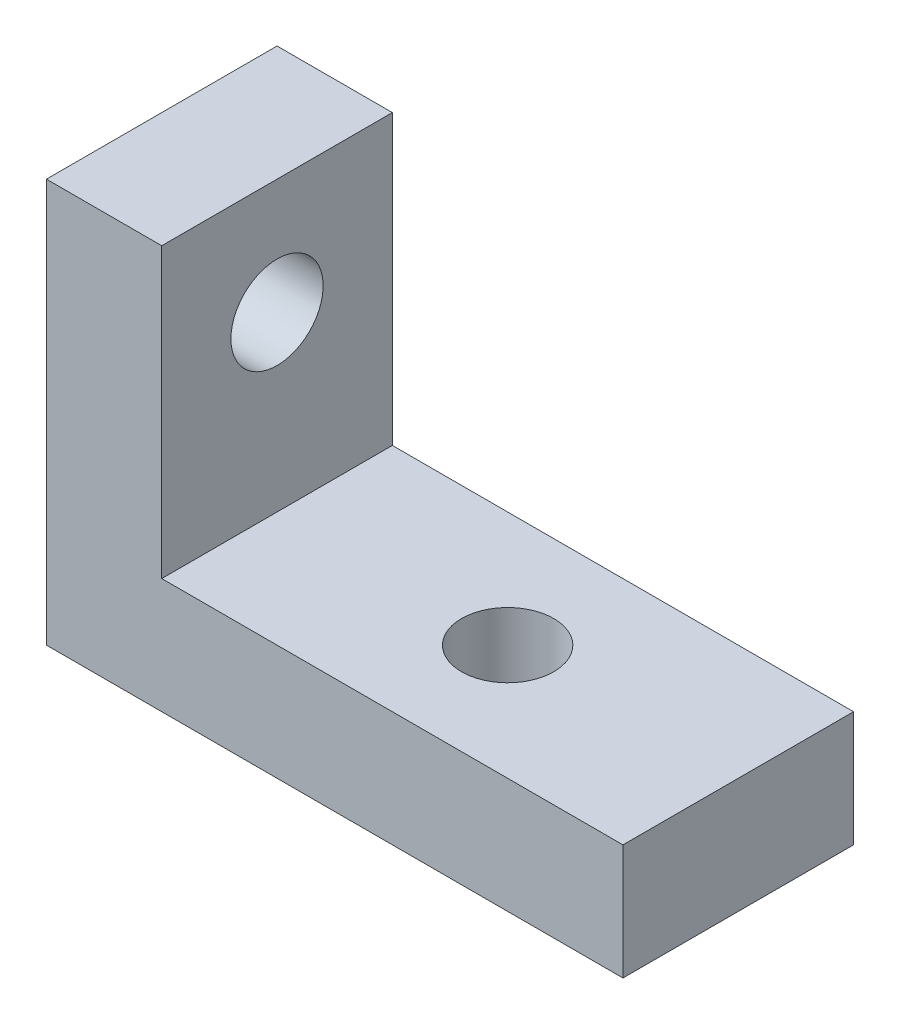
ISO-10303-21;
HEADER;
FILE_DESCRIPTION(('STEP AP214'),'2;1');
FILE_NAME('part.step','',(''),(''),'','','');
FILE_SCHEMA(('AUTOMOTIVE_DESIGN { 1 0 10303 214 1 1 1 1 }'));
ENDSEC;
DATA;
#1=APPLICATION_CONTEXT('core data for automotive mechanical design processes');
#2=APPLICATION_PROTOCOL_DEFINITION('international standard','automotive_design',2000,#1);
#3=PRODUCT_CONTEXT('',#1,'mechanical');
#4=PRODUCT('Part','Part','',(#3));
#5=PRODUCT_RELATED_PRODUCT_CATEGORY('part','',(#4));
#6=PRODUCT_DEFINITION_FORMATION('','',#4);
#7=PRODUCT_DEFINITION_CONTEXT('part definition',#1,'design');
#8=PRODUCT_DEFINITION('design','',#6,#7);
#9=PRODUCT_DEFINITION_SHAPE('','',#8);
#10=(LENGTH_UNIT() NAMED_UNIT(*) SI_UNIT(.MILLI.,.METRE.));
#11=(NAMED_UNIT(*) PLANE_ANGLE_UNIT() SI_UNIT($,.RADIAN.));
#12=(NAMED_UNIT(*) SI_UNIT($,.STERADIAN.) SOLID_ANGLE_UNIT());
#13=UNCERTAINTY_MEASURE_WITH_UNIT(LENGTH_MEASURE(1.E-05),#10,'distance_accuracy_value','');
#14=(GEOMETRIC_REPRESENTATION_CONTEXT(3) GLOBAL_UNCERTAINTY_ASSIGNED_CONTEXT((#13)) GLOBAL_UNIT_ASSIGNED_CONTEXT((#10,
#11,#12)) REPRESENTATION_CONTEXT('',''));
#15=CARTESIAN_POINT('',(0.,0.,0.));
#16=DIRECTION('',(0.,0.,1.));
#17=DIRECTION('',(1.,0.,0.));
#18=AXIS2_PLACEMENT_3D('',#15,#16,#17);
#19=CARTESIAN_POINT('',(-3.21733333333332,-27.3473333333333,5.08));
#20=DIRECTION('',(0.,-1.,0.));
#21=DIRECTION('',(1.,0.,0.));
#22=AXIS2_PLACEMENT_3D('',#19,#20,#21);
#23=PLANE('',#22);
#24=CARTESIAN_POINT('',(-8.29733333333332,-27.3473333333333,2.54));
#25=DIRECTION('',(0.,1.,0.));
#26=DIRECTION('',(-1.,0.,0.));
#27=AXIS2_PLACEMENT_3D('',#24,#25,#26);
#28=CIRCLE('',#27,1.016);
#29=CARTESIAN_POINT('',(-9.31333333333332,-27.3473333333333,2.54));
#30=VERTEX_POINT('',#29);
#31=EDGE_CURVE('E183',#30,#30,#28,.T.);
#32=ORIENTED_EDGE('',*,*,#31,.F.);
#33=EDGE_LOOP('',(#32));
#34=FACE_BOUND('',#33,.T.);
#35=DIRECTION('',(-1.,0.,0.));
#36=VECTOR('',#35,1.);
#37=CARTESIAN_POINT('',(-3.21733333333332,-27.3473333333333,0.));
#38=LINE('',#37,#36);
#39=CARTESIAN_POINT('',(-3.21733333333332,-27.3473333333333,0.));
#40=VERTEX_POINT('',#39);
#41=CARTESIAN_POINT('',(-13.3773333333333,-27.3473333333333,0.));
#42=VERTEX_POINT('',#41);
#43=EDGE_CURVE('E129',#40,#42,#38,.T.);
#44=ORIENTED_EDGE('',*,*,#43,.T.);
#45=DIRECTION('',(0.,0.,-1.));
#46=VECTOR('',#45,1.);
#47=CARTESIAN_POINT('',(-13.3773333333333,-27.3473333333333,5.08));
#48=LINE('',#47,#46);
#49=CARTESIAN_POINT('',(-13.3773333333333,-27.3473333333333,5.08));
#50=VERTEX_POINT('',#49);
#51=EDGE_CURVE('E11',#50,#42,#48,.T.);
#52=ORIENTED_EDGE('',*,*,#51,.F.);
#53=DIRECTION('',(-1.,0.,0.));
#54=VECTOR('',#53,1.);
#55=CARTESIAN_POINT('',(-3.21733333333332,-27.3473333333333,5.08));
#56=LINE('',#55,#54);
#57=CARTESIAN_POINT('',(-3.21733333333332,-27.3473333333333,5.08));
#58=VERTEX_POINT('',#57);
#59=EDGE_CURVE('E145',#58,#50,#56,.T.);
#60=ORIENTED_EDGE('',*,*,#59,.F.);
#61=DIRECTION('',(0.,0.,-1.));
#62=VECTOR('',#61,1.);
#63=CARTESIAN_POINT('',(-3.21733333333332,-27.3473333333333,5.08));
#64=LINE('',#63,#62);
#65=EDGE_CURVE('E125',#58,#40,#64,.T.);
#66=ORIENTED_EDGE('',*,*,#65,.T.);
#67=EDGE_LOOP('',(#44,#52,#60,#66));
#68=FACE_BOUND('',#67,.T.);
#69=ADVANCED_FACE('F39',(#34,#68),#23,.F.);
#70=CARTESIAN_POINT('',(-13.3773333333333,-27.3473333333333,5.08));
#71=DIRECTION('',(-1.,0.,0.));
#72=DIRECTION('',(0.,-1.,0.));
#73=AXIS2_PLACEMENT_3D('',#70,#71,#72);
#74=PLANE('',#73);
#75=CARTESIAN_POINT('',(-13.3773333333333,-23.5373333333333,2.54));
#76=DIRECTION('',(-1.,0.,0.));
#77=DIRECTION('',(0.,0.,1.));
#78=AXIS2_PLACEMENT_3D('',#75,#76,#77);
#79=CIRCLE('',#78,1.016);
#80=CARTESIAN_POINT('',(-13.3773333333333,-23.5373333333333,3.556));
#81=VERTEX_POINT('',#80);
#82=EDGE_CURVE('E186',#81,#81,#79,.T.);
#83=ORIENTED_EDGE('',*,*,#82,.T.);
#84=EDGE_LOOP('',(#83));
#85=FACE_BOUND('',#84,.T.);
#86=DIRECTION('',(0.,1.,0.));
#87=VECTOR('',#86,1.);
#88=CARTESIAN_POINT('',(-13.3773333333333,-27.3473333333333,0.));
#89=LINE('',#88,#87);
#90=CARTESIAN_POINT('',(-13.3773333333333,-20.9973333333333,0.));
#91=VERTEX_POINT('',#90);
#92=EDGE_CURVE('E133',#42,#91,#89,.T.);
#93=ORIENTED_EDGE('',*,*,#92,.T.);
#94=DIRECTION('',(0.,0.,-1.));
#95=VECTOR('',#94,1.);
#96=CARTESIAN_POINT('',(-13.3773333333333,-20.9973333333333,5.08));
#97=LINE('',#96,#95);
#98=CARTESIAN_POINT('',(-13.3773333333333,-20.9973333333333,5.08));
#99=VERTEX_POINT('',#98);
#100=EDGE_CURVE('E49',#99,#91,#97,.T.);
#101=ORIENTED_EDGE('',*,*,#100,.F.);
#102=DIRECTION('',(0.,1.,0.));
#103=VECTOR('',#102,1.);
#104=CARTESIAN_POINT('',(-13.3773333333333,-27.3473333333333,5.08));
#105=LINE('',#104,#103);
#106=EDGE_CURVE('E94',#50,#99,#105,.T.);
#107=ORIENTED_EDGE('',*,*,#106,.F.);
#108=ORIENTED_EDGE('',*,*,#51,.T.);
#109=EDGE_LOOP('',(#93,#101,#107,#108));
#110=FACE_BOUND('',#109,.T.);
#111=ADVANCED_FACE('F175',(#85,#110),#74,.F.);
#112=CARTESIAN_POINT('',(-13.3773333333333,-20.9973333333333,5.08));
#113=DIRECTION('',(0.,-1.,0.));
#114=DIRECTION('',(0.,0.,-1.));
#115=AXIS2_PLACEMENT_3D('',#112,#113,#114);
#116=PLANE('',#115);
#117=DIRECTION('',(-1.,0.,0.));
#118=VECTOR('',#117,1.);
#119=CARTESIAN_POINT('',(-13.3773333333333,-20.9973333333333,0.));
#120=LINE('',#119,#118);
#121=CARTESIAN_POINT('',(-15.9173333333333,-20.9973333333333,0.));
#122=VERTEX_POINT('',#121);
#123=EDGE_CURVE('E136',#91,#122,#120,.T.);
#124=ORIENTED_EDGE('',*,*,#123,.T.);
#125=DIRECTION('',(0.,0.,-1.));
#126=VECTOR('',#125,1.);
#127=CARTESIAN_POINT('',(-15.9173333333333,-20.9973333333333,5.08));
#128=LINE('',#127,#126);
#129=CARTESIAN_POINT('',(-15.9173333333333,-20.9973333333333,5.08));
#130=VERTEX_POINT('',#129);
#131=EDGE_CURVE('E118',#130,#122,#128,.T.);
#132=ORIENTED_EDGE('',*,*,#131,.F.);
#133=DIRECTION('',(-1.,0.,0.));
#134=VECTOR('',#133,1.);
#135=CARTESIAN_POINT('',(-13.3773333333333,-20.9973333333333,5.08));
#136=LINE('',#135,#134);
#137=EDGE_CURVE('E107',#99,#130,#136,.T.);
#138=ORIENTED_EDGE('',*,*,#137,.F.);
#139=ORIENTED_EDGE('',*,*,#100,.T.);
#140=EDGE_LOOP('',(#124,#132,#138,#139));
#141=FACE_BOUND('',#140,.T.);
#142=ADVANCED_FACE('F156',(#141),#116,.F.);
#143=CARTESIAN_POINT('',(-15.9173333333333,-20.9973333333333,5.08));
#144=DIRECTION('',(1.,0.,0.));
#145=DIRECTION('',(0.,0.,-1.));
#146=AXIS2_PLACEMENT_3D('',#143,#144,#145);
#147=PLANE('',#146);
#148=CARTESIAN_POINT('',(-15.9173333333333,-23.5373333333333,2.54));
#149=DIRECTION('',(-1.,0.,0.));
#150=DIRECTION('',(0.,0.,1.));
#151=AXIS2_PLACEMENT_3D('',#148,#149,#150);
#152=CIRCLE('',#151,1.016);
#153=CARTESIAN_POINT('',(-15.9173333333333,-23.5373333333333,3.556));
#154=VERTEX_POINT('',#153);
#155=EDGE_CURVE('E192',#154,#154,#152,.T.);
#156=ORIENTED_EDGE('',*,*,#155,.F.);
#157=EDGE_LOOP('',(#156));
#158=FACE_BOUND('',#157,.T.);
#159=DIRECTION('',(0.,-1.,0.));
#160=VECTOR('',#159,1.);
#161=CARTESIAN_POINT('',(-15.9173333333333,-20.9973333333333,0.));
#162=LINE('',#161,#160);
#163=CARTESIAN_POINT('',(-15.9173333333333,-29.8873333333333,0.));
#164=VERTEX_POINT('',#163);
#165=EDGE_CURVE('E116',#122,#164,#162,.T.);
#166=ORIENTED_EDGE('',*,*,#165,.T.);
#167=DIRECTION('',(0.,0.,-1.));
#168=VECTOR('',#167,1.);
#169=CARTESIAN_POINT('',(-15.9173333333333,-29.8873333333333,5.08));
#170=LINE('',#169,#168);
#171=CARTESIAN_POINT('',(-15.9173333333333,-29.8873333333333,5.08));
#172=VERTEX_POINT('',#171);
#173=EDGE_CURVE('E113',#172,#164,#170,.T.);
#174=ORIENTED_EDGE('',*,*,#173,.F.);
#175=DIRECTION('',(0.,-1.,0.));
#176=VECTOR('',#175,1.);
#177=CARTESIAN_POINT('',(-15.9173333333333,-20.9973333333333,5.08));
#178=LINE('',#177,#176);
#179=EDGE_CURVE('E101',#130,#172,#178,.T.);
#180=ORIENTED_EDGE('',*,*,#179,.F.);
#181=ORIENTED_EDGE('',*,*,#131,.T.);
#182=EDGE_LOOP('',(#166,#174,#180,#181));
#183=FACE_BOUND('',#182,.T.);
#184=ADVANCED_FACE('F114',(#158,#183),#147,.F.);
#185=CARTESIAN_POINT('',(-15.9173333333333,-29.8873333333333,5.08));
#186=DIRECTION('',(0.,1.,0.));
#187=DIRECTION('',(-1.,0.,0.));
#188=AXIS2_PLACEMENT_3D('',#185,#186,#187);
#189=PLANE('',#188);
#190=CARTESIAN_POINT('',(-8.29733333333332,-29.8873333333333,2.54));
#191=DIRECTION('',(0.,1.,0.));
#192=DIRECTION('',(-1.,0.,0.));
#193=AXIS2_PLACEMENT_3D('',#190,#191,#192);
#194=CIRCLE('',#193,1.016);
#195=CARTESIAN_POINT('',(-9.31333333333332,-29.8873333333333,2.54));
#196=VERTEX_POINT('',#195);
#197=EDGE_CURVE('E42',#196,#196,#194,.T.);
#198=ORIENTED_EDGE('',*,*,#197,.T.);
#199=EDGE_LOOP('',(#198));
#200=FACE_BOUND('',#199,.T.);
#201=DIRECTION('',(1.,0.,0.));
#202=VECTOR('',#201,1.);
#203=CARTESIAN_POINT('',(-15.9173333333333,-29.8873333333333,0.));
#204=LINE('',#203,#202);
#205=CARTESIAN_POINT('',(-3.21733333333332,-29.8873333333333,0.));
#206=VERTEX_POINT('',#205);
#207=EDGE_CURVE('E80',#164,#206,#204,.T.);
#208=ORIENTED_EDGE('',*,*,#207,.T.);
#209=DIRECTION('',(0.,0.,-1.));
#210=VECTOR('',#209,1.);
#211=CARTESIAN_POINT('',(-3.21733333333332,-29.8873333333333,5.08));
#212=LINE('',#211,#210);
#213=CARTESIAN_POINT('',(-3.21733333333332,-29.8873333333333,5.08));
#214=VERTEX_POINT('',#213);
#215=EDGE_CURVE('E119',#214,#206,#212,.T.);
#216=ORIENTED_EDGE('',*,*,#215,.F.);
#217=DIRECTION('',(1.,0.,0.));
#218=VECTOR('',#217,1.);
#219=CARTESIAN_POINT('',(-15.9173333333333,-29.8873333333333,5.08));
#220=LINE('',#219,#218);
#221=EDGE_CURVE('E105',#172,#214,#220,.T.);
#222=ORIENTED_EDGE('',*,*,#221,.F.);
#223=ORIENTED_EDGE('',*,*,#173,.T.);
#224=EDGE_LOOP('',(#208,#216,#222,#223));
#225=FACE_BOUND('',#224,.T.);
#226=ADVANCED_FACE('F121',(#200,#225),#189,.F.);
#227=CARTESIAN_POINT('',(-3.21733333333332,-29.8873333333333,5.08));
#228=DIRECTION('',(-1.,0.,0.));
#229=DIRECTION('',(0.,0.,1.));
#230=AXIS2_PLACEMENT_3D('',#227,#228,#229);
#231=PLANE('',#230);
#232=DIRECTION('',(0.,1.,0.));
#233=VECTOR('',#232,1.);
#234=CARTESIAN_POINT('',(-3.21733333333332,-29.8873333333333,0.));
#235=LINE('',#234,#233);
#236=EDGE_CURVE('E86',#206,#40,#235,.T.);
#237=ORIENTED_EDGE('',*,*,#236,.T.);
#238=ORIENTED_EDGE('',*,*,#65,.F.);
#239=DIRECTION('',(0.,1.,0.));
#240=VECTOR('',#239,1.);
#241=CARTESIAN_POINT('',(-3.21733333333332,-29.8873333333333,5.08));
#242=LINE('',#241,#240);
#243=EDGE_CURVE('E57',#214,#58,#242,.T.);
#244=ORIENTED_EDGE('',*,*,#243,.F.);
#245=ORIENTED_EDGE('',*,*,#215,.T.);
#246=EDGE_LOOP('',(#237,#238,#244,#245));
#247=FACE_BOUND('',#246,.T.);
#248=ADVANCED_FACE('F163',(#247),#231,.F.);
#249=CARTESIAN_POINT('',(0.,0.,5.08));
#250=DIRECTION('',(0.,0.,-1.));
#251=DIRECTION('',(-1.,0.,0.));
#252=AXIS2_PLACEMENT_3D('',#249,#250,#251);
#253=PLANE('',#252);
#254=ORIENTED_EDGE('',*,*,#59,.T.);
#255=ORIENTED_EDGE('',*,*,#106,.T.);
#256=ORIENTED_EDGE('',*,*,#137,.T.);
#257=ORIENTED_EDGE('',*,*,#179,.T.);
#258=ORIENTED_EDGE('',*,*,#221,.T.);
#259=ORIENTED_EDGE('',*,*,#243,.T.);
#260=EDGE_LOOP('',(#254,#255,#256,#257,#258,#259));
#261=FACE_BOUND('',#260,.T.);
#262=ADVANCED_FACE('F103',(#261),#253,.F.);
#263=CARTESIAN_POINT('',(0.,0.,0.));
#264=DIRECTION('',(0.,0.,-1.));
#265=DIRECTION('',(-1.,0.,0.));
#266=AXIS2_PLACEMENT_3D('',#263,#264,#265);
#267=PLANE('',#266);
#268=ORIENTED_EDGE('',*,*,#43,.F.);
#269=ORIENTED_EDGE('',*,*,#236,.F.);
#270=ORIENTED_EDGE('',*,*,#207,.F.);
#271=ORIENTED_EDGE('',*,*,#165,.F.);
#272=ORIENTED_EDGE('',*,*,#123,.F.);
#273=ORIENTED_EDGE('',*,*,#92,.F.);
#274=EDGE_LOOP('',(#268,#269,#270,#271,#272,#273));
#275=FACE_BOUND('',#274,.T.);
#276=ADVANCED_FACE('F159',(#275),#267,.T.);
#277=CARTESIAN_POINT('',(-8.29733333333331,-52.7473333333333,2.54));
#278=DIRECTION('',(0.,1.,0.));
#279=DIRECTION('',(-1.,0.,0.));
#280=AXIS2_PLACEMENT_3D('',#277,#278,#279);
#281=CYLINDRICAL_SURFACE('',#280,1.016);
#282=ORIENTED_EDGE('',*,*,#31,.T.);
#283=EDGE_LOOP('',(#282));
#284=FACE_BOUND('',#283,.T.);
#285=ORIENTED_EDGE('',*,*,#197,.F.);
#286=EDGE_LOOP('',(#285));
#287=FACE_BOUND('',#286,.T.);
#288=ADVANCED_FACE('F224',(#284,#287),#281,.F.);
#289=CARTESIAN_POINT('',(-13.3773333333333,-23.5373333333333,2.54));
#290=DIRECTION('',(-1.,0.,0.));
#291=DIRECTION('',(0.,0.,1.));
#292=AXIS2_PLACEMENT_3D('',#289,#290,#291);
#293=CYLINDRICAL_SURFACE('',#292,1.016);
#294=ORIENTED_EDGE('',*,*,#82,.F.);
#295=EDGE_LOOP('',(#294));
#296=FACE_BOUND('',#295,.T.);
#297=ORIENTED_EDGE('',*,*,#155,.T.);
#298=EDGE_LOOP('',(#297));
#299=FACE_BOUND('',#298,.T.);
#300=ADVANCED_FACE('F204',(#296,#299),#293,.F.);
#301=CLOSED_SHELL('',(#69,#111,#142,#184,#226,#248,#262,#276,#288,#300));
#302=MANIFOLD_SOLID_BREP('B2',#301);
#303=ADVANCED_BREP_SHAPE_REPRESENTATION('',(#18,#302),#14);
#304=SHAPE_DEFINITION_REPRESENTATION(#9,#303);
ENDSEC;
END-ISO-10303-21;
